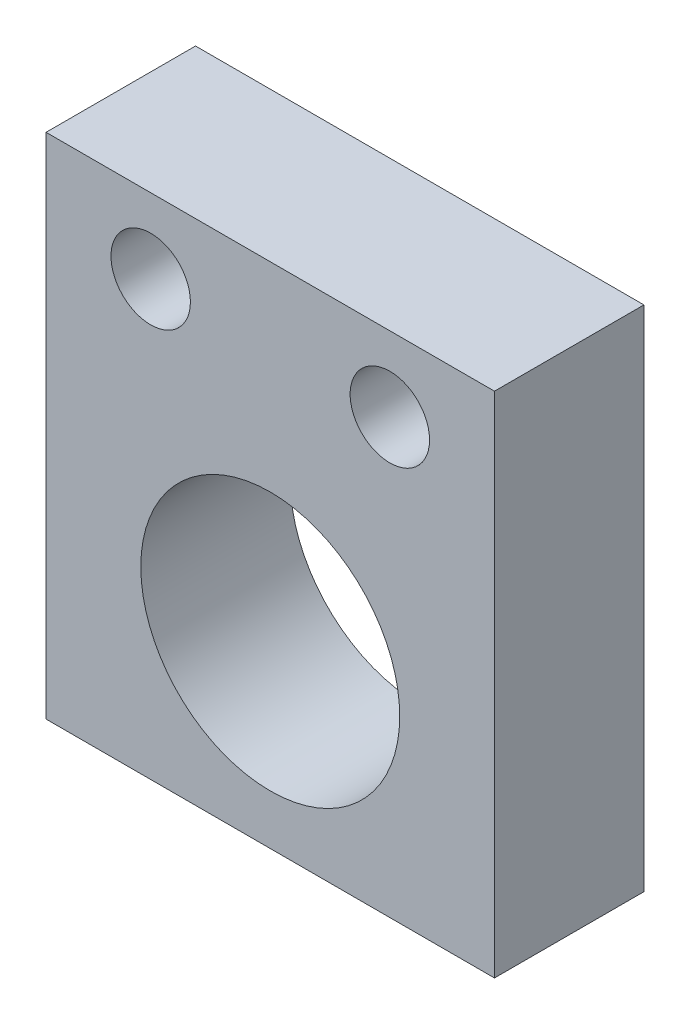
ISO-10303-21;
HEADER;
FILE_DESCRIPTION(('STEP AP214'),'2;1');
FILE_NAME('part.step','',(''),(''),'','','');
FILE_SCHEMA(('AUTOMOTIVE_DESIGN { 1 0 10303 214 1 1 1 1 }'));
ENDSEC;
DATA;
#1=APPLICATION_CONTEXT('core data for automotive mechanical design processes');
#2=APPLICATION_PROTOCOL_DEFINITION('international standard','automotive_design',2000,#1);
#3=PRODUCT_CONTEXT('',#1,'mechanical');
#4=PRODUCT('Part','Part','',(#3));
#5=PRODUCT_RELATED_PRODUCT_CATEGORY('part','',(#4));
#6=PRODUCT_DEFINITION_FORMATION('','',#4);
#7=PRODUCT_DEFINITION_CONTEXT('part definition',#1,'design');
#8=PRODUCT_DEFINITION('design','',#6,#7);
#9=PRODUCT_DEFINITION_SHAPE('','',#8);
#10=(LENGTH_UNIT() NAMED_UNIT(*) SI_UNIT(.MILLI.,.METRE.));
#11=(NAMED_UNIT(*) PLANE_ANGLE_UNIT() SI_UNIT($,.RADIAN.));
#12=(NAMED_UNIT(*) SI_UNIT($,.STERADIAN.) SOLID_ANGLE_UNIT());
#13=UNCERTAINTY_MEASURE_WITH_UNIT(LENGTH_MEASURE(1.E-05),#10,'distance_accuracy_value','');
#14=(GEOMETRIC_REPRESENTATION_CONTEXT(3) GLOBAL_UNCERTAINTY_ASSIGNED_CONTEXT((#13)) GLOBAL_UNIT_ASSIGNED_CONTEXT((#10,
#11,#12)) REPRESENTATION_CONTEXT('',''));
#15=CARTESIAN_POINT('',(0.,0.,0.));
#16=DIRECTION('',(0.,0.,1.));
#17=DIRECTION('',(1.,0.,0.));
#18=AXIS2_PLACEMENT_3D('',#15,#16,#17);
#19=CARTESIAN_POINT('',(0.,0.,-12.7));
#20=DIRECTION('',(0.,0.,-1.));
#21=DIRECTION('',(-1.,0.,0.));
#22=AXIS2_PLACEMENT_3D('',#19,#20,#21);
#23=PLANE('',#22);
#24=CARTESIAN_POINT('',(29.21,36.83,-12.7));
#25=DIRECTION('',(0.,0.,1.));
#26=DIRECTION('',(1.,0.,0.));
#27=AXIS2_PLACEMENT_3D('',#24,#25,#26);
#28=CIRCLE('',#27,3.37350099999999);
#29=CARTESIAN_POINT('',(32.583501,36.83,-12.7));
#30=VERTEX_POINT('',#29);
#31=EDGE_CURVE('E104',#30,#30,#28,.T.);
#32=ORIENTED_EDGE('',*,*,#31,.T.);
#33=EDGE_LOOP('',(#32));
#34=FACE_BOUND('',#33,.T.);
#35=DIRECTION('',(0.,-1.,0.));
#36=VECTOR('',#35,1.);
#37=CARTESIAN_POINT('',(0.,0.,-12.7));
#38=LINE('',#37,#36);
#39=CARTESIAN_POINT('',(0.,43.18,-12.7));
#40=VERTEX_POINT('',#39);
#41=CARTESIAN_POINT('',(0.,0.,-12.7));
#42=VERTEX_POINT('',#41);
#43=EDGE_CURVE('E124',#40,#42,#38,.T.);
#44=ORIENTED_EDGE('',*,*,#43,.F.);
#45=DIRECTION('',(-1.,0.,0.));
#46=VECTOR('',#45,1.);
#47=CARTESIAN_POINT('',(0.,43.18,-12.7));
#48=LINE('',#47,#46);
#49=CARTESIAN_POINT('',(38.1,43.18,-12.7));
#50=VERTEX_POINT('',#49);
#51=EDGE_CURVE('E131',#50,#40,#48,.T.);
#52=ORIENTED_EDGE('',*,*,#51,.F.);
#53=DIRECTION('',(0.,1.,0.));
#54=VECTOR('',#53,1.);
#55=CARTESIAN_POINT('',(38.1,0.,-12.7));
#56=LINE('',#55,#54);
#57=CARTESIAN_POINT('',(38.1,0.,-12.7));
#58=VERTEX_POINT('',#57);
#59=EDGE_CURVE('E129',#58,#50,#56,.T.);
#60=ORIENTED_EDGE('',*,*,#59,.F.);
#61=DIRECTION('',(1.,0.,0.));
#62=VECTOR('',#61,1.);
#63=CARTESIAN_POINT('',(0.,0.,-12.7));
#64=LINE('',#63,#62);
#65=EDGE_CURVE('E126',#42,#58,#64,.T.);
#66=ORIENTED_EDGE('',*,*,#65,.F.);
#67=EDGE_LOOP('',(#44,#52,#60,#66));
#68=FACE_BOUND('',#67,.T.);
#69=CARTESIAN_POINT('',(19.05,15.24,-12.7));
#70=DIRECTION('',(0.,0.,1.));
#71=DIRECTION('',(1.,0.,0.));
#72=AXIS2_PLACEMENT_3D('',#69,#70,#71);
#73=CIRCLE('',#72,11.);
#74=CARTESIAN_POINT('',(30.05,15.24,-12.7));
#75=VERTEX_POINT('',#74);
#76=EDGE_CURVE('E118',#75,#75,#73,.T.);
#77=ORIENTED_EDGE('',*,*,#76,.T.);
#78=EDGE_LOOP('',(#77));
#79=FACE_BOUND('',#78,.T.);
#80=CARTESIAN_POINT('',(8.89,36.83,-12.7));
#81=DIRECTION('',(0.,0.,1.));
#82=DIRECTION('',(1.,0.,0.));
#83=AXIS2_PLACEMENT_3D('',#80,#81,#82);
#84=CIRCLE('',#83,3.373501);
#85=CARTESIAN_POINT('',(12.263501,36.83,-12.7));
#86=VERTEX_POINT('',#85);
#87=EDGE_CURVE('E114',#86,#86,#84,.T.);
#88=ORIENTED_EDGE('',*,*,#87,.T.);
#89=EDGE_LOOP('',(#88));
#90=FACE_BOUND('',#89,.T.);
#91=ADVANCED_FACE('F40',(#34,#68,#79,#90),#23,.T.);
#92=CARTESIAN_POINT('',(0.,0.,-12.7));
#93=DIRECTION('',(-1.,0.,0.));
#94=DIRECTION('',(0.,0.,1.));
#95=AXIS2_PLACEMENT_3D('',#92,#93,#94);
#96=PLANE('',#95);
#97=CARTESIAN_POINT('',(0.,27.94,-6.34999999999999));
#98=DIRECTION('',(-1.,0.,0.));
#99=DIRECTION('',(0.,0.,1.));
#100=AXIS2_PLACEMENT_3D('',#97,#98,#99);
#101=CIRCLE('',#100,2.55269999999999);
#102=CARTESIAN_POINT('',(0.,27.94,-3.7973));
#103=VERTEX_POINT('',#102);
#104=EDGE_CURVE('E101',#103,#103,#101,.T.);
#105=ORIENTED_EDGE('',*,*,#104,.F.);
#106=EDGE_LOOP('',(#105));
#107=FACE_BOUND('',#106,.T.);
#108=DIRECTION('',(0.,-1.,0.));
#109=VECTOR('',#108,1.);
#110=CARTESIAN_POINT('',(0.,0.,0.));
#111=LINE('',#110,#109);
#112=CARTESIAN_POINT('',(0.,43.18,0.));
#113=VERTEX_POINT('',#112);
#114=CARTESIAN_POINT('',(0.,0.,0.));
#115=VERTEX_POINT('',#114);
#116=EDGE_CURVE('E121',#113,#115,#111,.T.);
#117=ORIENTED_EDGE('',*,*,#116,.F.);
#118=DIRECTION('',(0.,0.,1.));
#119=VECTOR('',#118,1.);
#120=CARTESIAN_POINT('',(0.,43.18,-12.7));
#121=LINE('',#120,#119);
#122=EDGE_CURVE('E11',#40,#113,#121,.T.);
#123=ORIENTED_EDGE('',*,*,#122,.F.);
#124=ORIENTED_EDGE('',*,*,#43,.T.);
#125=DIRECTION('',(0.,0.,1.));
#126=VECTOR('',#125,1.);
#127=CARTESIAN_POINT('',(0.,0.,-12.7));
#128=LINE('',#127,#126);
#129=EDGE_CURVE('E44',#42,#115,#128,.T.);
#130=ORIENTED_EDGE('',*,*,#129,.T.);
#131=EDGE_LOOP('',(#117,#123,#124,#130));
#132=FACE_BOUND('',#131,.T.);
#133=ADVANCED_FACE('F42',(#107,#132),#96,.T.);
#134=CARTESIAN_POINT('',(0.,43.18,-12.7));
#135=DIRECTION('',(0.,1.,0.));
#136=DIRECTION('',(0.,0.,1.));
#137=AXIS2_PLACEMENT_3D('',#134,#135,#136);
#138=PLANE('',#137);
#139=DIRECTION('',(-1.,0.,0.));
#140=VECTOR('',#139,1.);
#141=CARTESIAN_POINT('',(0.,43.18,0.));
#142=LINE('',#141,#140);
#143=CARTESIAN_POINT('',(38.1,43.18,0.));
#144=VERTEX_POINT('',#143);
#145=EDGE_CURVE('E127',#144,#113,#142,.T.);
#146=ORIENTED_EDGE('',*,*,#145,.F.);
#147=DIRECTION('',(0.,0.,1.));
#148=VECTOR('',#147,1.);
#149=CARTESIAN_POINT('',(38.1,43.18,-12.7));
#150=LINE('',#149,#148);
#151=EDGE_CURVE('E50',#50,#144,#150,.T.);
#152=ORIENTED_EDGE('',*,*,#151,.F.);
#153=ORIENTED_EDGE('',*,*,#51,.T.);
#154=ORIENTED_EDGE('',*,*,#122,.T.);
#155=EDGE_LOOP('',(#146,#152,#153,#154));
#156=FACE_BOUND('',#155,.T.);
#157=ADVANCED_FACE('F146',(#156),#138,.T.);
#158=CARTESIAN_POINT('',(38.1,0.,-12.7));
#159=DIRECTION('',(1.,0.,0.));
#160=DIRECTION('',(0.,0.,-1.));
#161=AXIS2_PLACEMENT_3D('',#158,#159,#160);
#162=PLANE('',#161);
#163=DIRECTION('',(0.,1.,0.));
#164=VECTOR('',#163,1.);
#165=CARTESIAN_POINT('',(38.1,0.,0.));
#166=LINE('',#165,#164);
#167=CARTESIAN_POINT('',(38.1,0.,0.));
#168=VERTEX_POINT('',#167);
#169=EDGE_CURVE('E138',#168,#144,#166,.T.);
#170=ORIENTED_EDGE('',*,*,#169,.F.);
#171=DIRECTION('',(0.,0.,1.));
#172=VECTOR('',#171,1.);
#173=CARTESIAN_POINT('',(38.1,0.,-12.7));
#174=LINE('',#173,#172);
#175=EDGE_CURVE('E142',#58,#168,#174,.T.);
#176=ORIENTED_EDGE('',*,*,#175,.F.);
#177=ORIENTED_EDGE('',*,*,#59,.T.);
#178=ORIENTED_EDGE('',*,*,#151,.T.);
#179=EDGE_LOOP('',(#170,#176,#177,#178));
#180=FACE_BOUND('',#179,.T.);
#181=ADVANCED_FACE('F149',(#180),#162,.T.);
#182=CARTESIAN_POINT('',(0.,0.,-12.7));
#183=DIRECTION('',(0.,-1.,0.));
#184=DIRECTION('',(0.,0.,-1.));
#185=AXIS2_PLACEMENT_3D('',#182,#183,#184);
#186=PLANE('',#185);
#187=DIRECTION('',(1.,0.,0.));
#188=VECTOR('',#187,1.);
#189=CARTESIAN_POINT('',(0.,0.,0.));
#190=LINE('',#189,#188);
#191=EDGE_CURVE('E135',#115,#168,#190,.T.);
#192=ORIENTED_EDGE('',*,*,#191,.F.);
#193=ORIENTED_EDGE('',*,*,#129,.F.);
#194=ORIENTED_EDGE('',*,*,#65,.T.);
#195=ORIENTED_EDGE('',*,*,#175,.T.);
#196=EDGE_LOOP('',(#192,#193,#194,#195));
#197=FACE_BOUND('',#196,.T.);
#198=ADVANCED_FACE('F143',(#197),#186,.T.);
#199=CARTESIAN_POINT('',(0.,0.,0.));
#200=DIRECTION('',(0.,0.,-1.));
#201=DIRECTION('',(-1.,0.,0.));
#202=AXIS2_PLACEMENT_3D('',#199,#200,#201);
#203=PLANE('',#202);
#204=CARTESIAN_POINT('',(29.21,36.83,0.));
#205=DIRECTION('',(0.,0.,1.));
#206=DIRECTION('',(1.,0.,0.));
#207=AXIS2_PLACEMENT_3D('',#204,#205,#206);
#208=CIRCLE('',#207,3.373501);
#209=CARTESIAN_POINT('',(32.583501,36.83,0.));
#210=VERTEX_POINT('',#209);
#211=EDGE_CURVE('E100',#210,#210,#208,.T.);
#212=ORIENTED_EDGE('',*,*,#211,.F.);
#213=EDGE_LOOP('',(#212));
#214=FACE_BOUND('',#213,.T.);
#215=CARTESIAN_POINT('',(8.89,36.83,0.));
#216=DIRECTION('',(0.,0.,1.));
#217=DIRECTION('',(1.,0.,0.));
#218=AXIS2_PLACEMENT_3D('',#215,#216,#217);
#219=CIRCLE('',#218,3.373501);
#220=CARTESIAN_POINT('',(12.263501,36.83,0.));
#221=VERTEX_POINT('',#220);
#222=EDGE_CURVE('E111',#221,#221,#219,.T.);
#223=ORIENTED_EDGE('',*,*,#222,.F.);
#224=EDGE_LOOP('',(#223));
#225=FACE_BOUND('',#224,.T.);
#226=CARTESIAN_POINT('',(19.05,15.24,0.));
#227=DIRECTION('',(0.,0.,1.));
#228=DIRECTION('',(1.,0.,0.));
#229=AXIS2_PLACEMENT_3D('',#226,#227,#228);
#230=CIRCLE('',#229,11.);
#231=CARTESIAN_POINT('',(30.05,15.24,0.));
#232=VERTEX_POINT('',#231);
#233=EDGE_CURVE('E117',#232,#232,#230,.T.);
#234=ORIENTED_EDGE('',*,*,#233,.F.);
#235=EDGE_LOOP('',(#234));
#236=FACE_BOUND('',#235,.T.);
#237=ORIENTED_EDGE('',*,*,#116,.T.);
#238=ORIENTED_EDGE('',*,*,#191,.T.);
#239=ORIENTED_EDGE('',*,*,#169,.T.);
#240=ORIENTED_EDGE('',*,*,#145,.T.);
#241=EDGE_LOOP('',(#237,#238,#239,#240));
#242=FACE_BOUND('',#241,.T.);
#243=ADVANCED_FACE('F145',(#214,#225,#236,#242),#203,.F.);
#244=CARTESIAN_POINT('',(19.05,15.24,-12.7));
#245=DIRECTION('',(0.,0.,1.));
#246=DIRECTION('',(1.,0.,0.));
#247=AXIS2_PLACEMENT_3D('',#244,#245,#246);
#248=CYLINDRICAL_SURFACE('',#247,11.);
#249=ORIENTED_EDGE('',*,*,#76,.F.);
#250=EDGE_LOOP('',(#249));
#251=FACE_BOUND('',#250,.T.);
#252=ORIENTED_EDGE('',*,*,#233,.T.);
#253=EDGE_LOOP('',(#252));
#254=FACE_BOUND('',#253,.T.);
#255=ADVANCED_FACE('F162',(#251,#254),#248,.F.);
#256=CARTESIAN_POINT('',(8.89,36.83,0.));
#257=DIRECTION('',(0.,0.,1.));
#258=DIRECTION('',(1.,0.,0.));
#259=AXIS2_PLACEMENT_3D('',#256,#257,#258);
#260=CYLINDRICAL_SURFACE('',#259,3.373501);
#261=ORIENTED_EDGE('',*,*,#87,.F.);
#262=EDGE_LOOP('',(#261));
#263=FACE_BOUND('',#262,.T.);
#264=ORIENTED_EDGE('',*,*,#222,.T.);
#265=EDGE_LOOP('',(#264));
#266=FACE_BOUND('',#265,.T.);
#267=ADVANCED_FACE('F159',(#263,#266),#260,.F.);
#268=CARTESIAN_POINT('',(29.21,36.83,0.));
#269=DIRECTION('',(0.,0.,1.));
#270=DIRECTION('',(1.,0.,0.));
#271=AXIS2_PLACEMENT_3D('',#268,#269,#270);
#272=CYLINDRICAL_SURFACE('',#271,3.373501);
#273=ORIENTED_EDGE('',*,*,#31,.F.);
#274=EDGE_LOOP('',(#273));
#275=FACE_BOUND('',#274,.T.);
#276=ORIENTED_EDGE('',*,*,#211,.T.);
#277=EDGE_LOOP('',(#276));
#278=FACE_BOUND('',#277,.T.);
#279=ADVANCED_FACE('F94',(#275,#278),#272,.F.);
#280=CARTESIAN_POINT('',(12.7,27.94,-6.34999999999999));
#281=DIRECTION('',(-1.,0.,0.));
#282=DIRECTION('',(0.,0.,1.));
#283=AXIS2_PLACEMENT_3D('',#280,#281,#282);
#284=CONICAL_SURFACE('',#283,2.5527,1.02974425867665);
#285=CARTESIAN_POINT('',(14.2338169021917,27.94,-6.34999999999999));
#286=VERTEX_POINT('',#285);
#287=VERTEX_LOOP('',#286);
#288=FACE_BOUND('',#287,.T.);
#289=CARTESIAN_POINT('',(12.7,27.94,-6.34999999999999));
#290=DIRECTION('',(-1.,0.,0.));
#291=DIRECTION('',(0.,0.,1.));
#292=AXIS2_PLACEMENT_3D('',#289,#290,#291);
#293=CIRCLE('',#292,2.5527);
#294=CARTESIAN_POINT('',(12.7,27.94,-3.7973));
#295=VERTEX_POINT('',#294);
#296=EDGE_CURVE('E98',#295,#295,#293,.T.);
#297=ORIENTED_EDGE('',*,*,#296,.T.);
#298=EDGE_LOOP('',(#297));
#299=FACE_BOUND('',#298,.T.);
#300=ADVANCED_FACE('F90',(#288,#299),#284,.F.);
#301=CARTESIAN_POINT('',(0.,27.94,-6.34999999999999));
#302=DIRECTION('',(-1.,0.,0.));
#303=DIRECTION('',(0.,0.,1.));
#304=AXIS2_PLACEMENT_3D('',#301,#302,#303);
#305=CYLINDRICAL_SURFACE('',#304,2.55269999999999);
#306=ORIENTED_EDGE('',*,*,#296,.F.);
#307=EDGE_LOOP('',(#306));
#308=FACE_BOUND('',#307,.T.);
#309=ORIENTED_EDGE('',*,*,#104,.T.);
#310=EDGE_LOOP('',(#309));
#311=FACE_BOUND('',#310,.T.);
#312=ADVANCED_FACE('F93',(#308,#311),#305,.F.);
#313=CLOSED_SHELL('',(#91,#133,#157,#181,#198,#243,#255,#267,#279,#300,#312));
#314=MANIFOLD_SOLID_BREP('B2',#313);
#315=ADVANCED_BREP_SHAPE_REPRESENTATION('',(#18,#314),#14);
#316=SHAPE_DEFINITION_REPRESENTATION(#9,#315);
ENDSEC;
END-ISO-10303-21;
